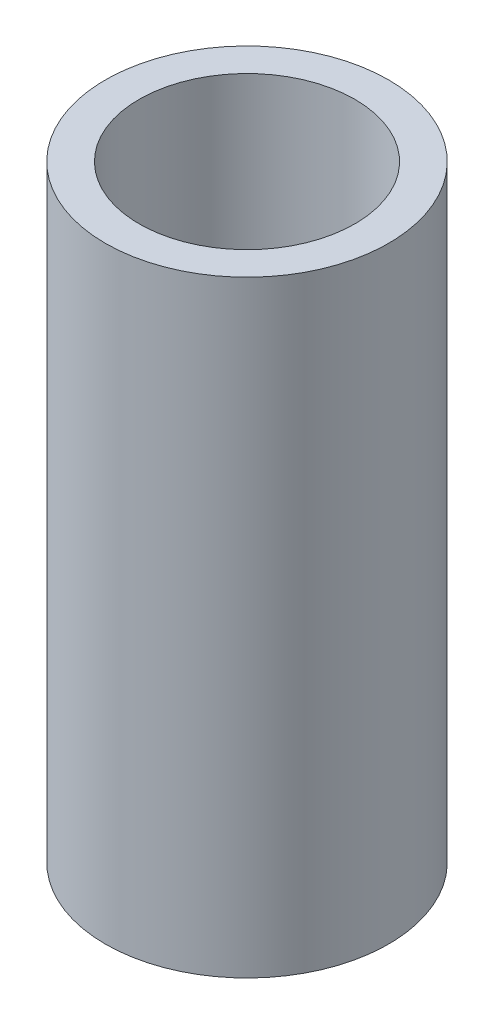
ISO-10303-21;
HEADER;
FILE_DESCRIPTION(('STEP AP214'),'2;1');
FILE_NAME('part.step','',(''),(''),'','','');
FILE_SCHEMA(('AUTOMOTIVE_DESIGN { 1 0 10303 214 1 1 1 1 }'));
ENDSEC;
DATA;
#1=APPLICATION_CONTEXT('core data for automotive mechanical design processes');
#2=APPLICATION_PROTOCOL_DEFINITION('international standard','automotive_design',2000,#1);
#3=PRODUCT_CONTEXT('',#1,'mechanical');
#4=PRODUCT('Part','Part','',(#3));
#5=PRODUCT_RELATED_PRODUCT_CATEGORY('part','',(#4));
#6=PRODUCT_DEFINITION_FORMATION('','',#4);
#7=PRODUCT_DEFINITION_CONTEXT('part definition',#1,'design');
#8=PRODUCT_DEFINITION('design','',#6,#7);
#9=PRODUCT_DEFINITION_SHAPE('','',#8);
#10=(LENGTH_UNIT() NAMED_UNIT(*) SI_UNIT(.MILLI.,.METRE.));
#11=(NAMED_UNIT(*) PLANE_ANGLE_UNIT() SI_UNIT($,.RADIAN.));
#12=(NAMED_UNIT(*) SI_UNIT($,.STERADIAN.) SOLID_ANGLE_UNIT());
#13=UNCERTAINTY_MEASURE_WITH_UNIT(LENGTH_MEASURE(1.E-05),#10,'distance_accuracy_value','');
#14=(GEOMETRIC_REPRESENTATION_CONTEXT(3) GLOBAL_UNCERTAINTY_ASSIGNED_CONTEXT((#13)) GLOBAL_UNIT_ASSIGNED_CONTEXT((#10,
#11,#12)) REPRESENTATION_CONTEXT('',''));
#15=CARTESIAN_POINT('',(0.,0.,0.));
#16=DIRECTION('',(0.,0.,1.));
#17=DIRECTION('',(1.,0.,0.));
#18=AXIS2_PLACEMENT_3D('',#15,#16,#17);
#19=CARTESIAN_POINT('',(0.,9.,0.));
#20=DIRECTION('',(0.,-1.,0.));
#21=DIRECTION('',(0.,0.,-1.));
#22=AXIS2_PLACEMENT_3D('',#19,#20,#21);
#23=CYLINDRICAL_SURFACE('',#22,1.6);
#24=CARTESIAN_POINT('',(0.,0.,0.));
#25=DIRECTION('',(0.,-1.,0.));
#26=DIRECTION('',(0.,0.,-1.));
#27=AXIS2_PLACEMENT_3D('',#24,#25,#26);
#28=CIRCLE('',#27,1.6);
#29=CARTESIAN_POINT('',(0.,0.,-1.6));
#30=VERTEX_POINT('',#29);
#31=EDGE_CURVE('E27',#30,#30,#28,.T.);
#32=ORIENTED_EDGE('',*,*,#31,.T.);
#33=EDGE_LOOP('',(#32));
#34=FACE_BOUND('',#33,.T.);
#35=CARTESIAN_POINT('',(0.,9.,0.));
#36=DIRECTION('',(0.,-1.,0.));
#37=DIRECTION('',(0.,0.,-1.));
#38=AXIS2_PLACEMENT_3D('',#35,#36,#37);
#39=CIRCLE('',#38,1.6);
#40=CARTESIAN_POINT('',(0.,9.,-1.6));
#41=VERTEX_POINT('',#40);
#42=EDGE_CURVE('E18',#41,#41,#39,.T.);
#43=ORIENTED_EDGE('',*,*,#42,.F.);
#44=EDGE_LOOP('',(#43));
#45=FACE_BOUND('',#44,.T.);
#46=ADVANCED_FACE('F15',(#34,#45),#23,.F.);
#47=CARTESIAN_POINT('',(0.,9.,0.));
#48=DIRECTION('',(0.,1.,0.));
#49=DIRECTION('',(0.,0.,1.));
#50=AXIS2_PLACEMENT_3D('',#47,#48,#49);
#51=PLANE('',#50);
#52=ORIENTED_EDGE('',*,*,#42,.T.);
#53=EDGE_LOOP('',(#52));
#54=FACE_BOUND('',#53,.T.);
#55=CARTESIAN_POINT('',(0.,9.,0.));
#56=DIRECTION('',(0.,-1.,0.));
#57=DIRECTION('',(0.,0.,-1.));
#58=AXIS2_PLACEMENT_3D('',#55,#56,#57);
#59=CIRCLE('',#58,2.1);
#60=CARTESIAN_POINT('',(0.,9.,-2.1));
#61=VERTEX_POINT('',#60);
#62=EDGE_CURVE('E22',#61,#61,#59,.T.);
#63=ORIENTED_EDGE('',*,*,#62,.F.);
#64=EDGE_LOOP('',(#63));
#65=FACE_BOUND('',#64,.T.);
#66=ADVANCED_FACE('F35',(#54,#65),#51,.T.);
#67=CARTESIAN_POINT('',(0.,0.,0.));
#68=DIRECTION('',(0.,1.,0.));
#69=DIRECTION('',(0.,0.,1.));
#70=AXIS2_PLACEMENT_3D('',#67,#68,#69);
#71=PLANE('',#70);
#72=ORIENTED_EDGE('',*,*,#31,.F.);
#73=EDGE_LOOP('',(#72));
#74=FACE_BOUND('',#73,.T.);
#75=CARTESIAN_POINT('',(0.,0.,0.));
#76=DIRECTION('',(0.,-1.,0.));
#77=DIRECTION('',(0.,0.,-1.));
#78=AXIS2_PLACEMENT_3D('',#75,#76,#77);
#79=CIRCLE('',#78,2.1);
#80=CARTESIAN_POINT('',(0.,0.,-2.1));
#81=VERTEX_POINT('',#80);
#82=EDGE_CURVE('E10',#81,#81,#79,.F.);
#83=ORIENTED_EDGE('',*,*,#82,.F.);
#84=EDGE_LOOP('',(#83));
#85=FACE_BOUND('',#84,.T.);
#86=ADVANCED_FACE('F43',(#74,#85),#71,.F.);
#87=CARTESIAN_POINT('',(0.,9.,0.));
#88=DIRECTION('',(0.,-1.,0.));
#89=DIRECTION('',(0.,0.,-1.));
#90=AXIS2_PLACEMENT_3D('',#87,#88,#89);
#91=CYLINDRICAL_SURFACE('',#90,2.1);
#92=ORIENTED_EDGE('',*,*,#82,.T.);
#93=EDGE_LOOP('',(#92));
#94=FACE_BOUND('',#93,.T.);
#95=ORIENTED_EDGE('',*,*,#62,.T.);
#96=EDGE_LOOP('',(#95));
#97=FACE_BOUND('',#96,.T.);
#98=ADVANCED_FACE('F44',(#94,#97),#91,.T.);
#99=CLOSED_SHELL('',(#46,#66,#86,#98));
#100=MANIFOLD_SOLID_BREP('B1',#99);
#101=ADVANCED_BREP_SHAPE_REPRESENTATION('',(#18,#100),#14);
#102=SHAPE_DEFINITION_REPRESENTATION(#9,#101);
ENDSEC;
END-ISO-10303-21;
